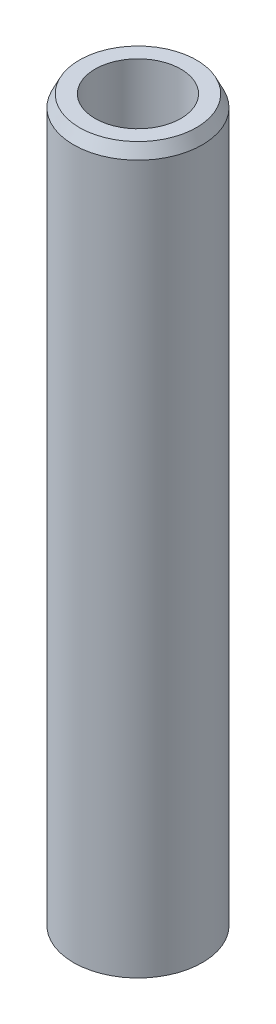
ISO-10303-21;
HEADER;
FILE_DESCRIPTION(('STEP AP214'),'2;1');
FILE_NAME('part.step','',(''),(''),'','','');
FILE_SCHEMA(('AUTOMOTIVE_DESIGN { 1 0 10303 214 1 1 1 1 }'));
ENDSEC;
DATA;
#1=APPLICATION_CONTEXT('core data for automotive mechanical design processes');
#2=APPLICATION_PROTOCOL_DEFINITION('international standard','automotive_design',2000,#1);
#3=PRODUCT_CONTEXT('',#1,'mechanical');
#4=PRODUCT('Part','Part','',(#3));
#5=PRODUCT_RELATED_PRODUCT_CATEGORY('part','',(#4));
#6=PRODUCT_DEFINITION_FORMATION('','',#4);
#7=PRODUCT_DEFINITION_CONTEXT('part definition',#1,'design');
#8=PRODUCT_DEFINITION('design','',#6,#7);
#9=PRODUCT_DEFINITION_SHAPE('','',#8);
#10=(LENGTH_UNIT() NAMED_UNIT(*) SI_UNIT(.MILLI.,.METRE.));
#11=(NAMED_UNIT(*) PLANE_ANGLE_UNIT() SI_UNIT($,.RADIAN.));
#12=(NAMED_UNIT(*) SI_UNIT($,.STERADIAN.) SOLID_ANGLE_UNIT());
#13=UNCERTAINTY_MEASURE_WITH_UNIT(LENGTH_MEASURE(1.E-05),#10,'distance_accuracy_value','');
#14=(GEOMETRIC_REPRESENTATION_CONTEXT(3) GLOBAL_UNCERTAINTY_ASSIGNED_CONTEXT((#13)) GLOBAL_UNIT_ASSIGNED_CONTEXT((#10,
#11,#12)) REPRESENTATION_CONTEXT('',''));
#15=CARTESIAN_POINT('',(0.,0.,0.));
#16=DIRECTION('',(0.,0.,1.));
#17=DIRECTION('',(1.,0.,0.));
#18=AXIS2_PLACEMENT_3D('',#15,#16,#17);
#19=CARTESIAN_POINT('',(0.,310.01596612534,0.));
#20=DIRECTION('',(0.,-1.,0.));
#21=DIRECTION('',(0.,0.,-1.));
#22=AXIS2_PLACEMENT_3D('',#19,#20,#21);
#23=CYLINDRICAL_SURFACE('',#22,27.5);
#24=CARTESIAN_POINT('',(0.,304.893666711075,0.));
#25=DIRECTION('',(0.,1.,0.));
#26=DIRECTION('',(0.,0.,1.));
#27=AXIS2_PLACEMENT_3D('',#24,#25,#26);
#28=CIRCLE('',#27,27.5);
#29=CARTESIAN_POINT('',(0.,304.893666711075,27.5));
#30=VERTEX_POINT('',#29);
#31=EDGE_CURVE('E50',#30,#30,#28,.F.);
#32=ORIENTED_EDGE('',*,*,#31,.T.);
#33=EDGE_LOOP('',(#32));
#34=FACE_BOUND('',#33,.T.);
#35=CARTESIAN_POINT('',(0.,2.50613545823342,0.));
#36=DIRECTION('',(0.,1.,0.));
#37=DIRECTION('',(0.,0.,1.));
#38=AXIS2_PLACEMENT_3D('',#35,#36,#37);
#39=CIRCLE('',#38,27.5);
#40=CARTESIAN_POINT('',(0.,2.50613545823342,27.5));
#41=VERTEX_POINT('',#40);
#42=EDGE_CURVE('E51',#41,#41,#39,.T.);
#43=ORIENTED_EDGE('',*,*,#42,.T.);
#44=EDGE_LOOP('',(#43));
#45=FACE_BOUND('',#44,.T.);
#46=ADVANCED_FACE('F39',(#34,#45),#23,.T.);
#47=CARTESIAN_POINT('',(0.,310.01596612534,0.));
#48=DIRECTION('',(0.,1.,0.));
#49=DIRECTION('',(0.,0.,1.));
#50=AXIS2_PLACEMENT_3D('',#47,#48,#49);
#51=PLANE('',#50);
#52=CARTESIAN_POINT('',(0.,310.01596612534,0.));
#53=DIRECTION('',(0.,1.,0.));
#54=DIRECTION('',(0.,0.,1.));
#55=AXIS2_PLACEMENT_3D('',#52,#53,#54);
#56=CIRCLE('',#55,24.9938645417666);
#57=CARTESIAN_POINT('',(0.,310.01596612534,24.9938645417666));
#58=VERTEX_POINT('',#57);
#59=EDGE_CURVE('E54',#58,#58,#56,.T.);
#60=ORIENTED_EDGE('',*,*,#59,.T.);
#61=EDGE_LOOP('',(#60));
#62=FACE_BOUND('',#61,.T.);
#63=CARTESIAN_POINT('',(0.,310.01596612534,0.));
#64=DIRECTION('',(0.,1.,0.));
#65=DIRECTION('',(0.,0.,1.));
#66=AXIS2_PLACEMENT_3D('',#63,#64,#65);
#67=CIRCLE('',#66,18.3057911645971);
#68=CARTESIAN_POINT('',(0.,310.01596612534,18.3057911645971));
#69=VERTEX_POINT('',#68);
#70=EDGE_CURVE('E58',#69,#69,#67,.T.);
#71=ORIENTED_EDGE('',*,*,#70,.F.);
#72=EDGE_LOOP('',(#71));
#73=FACE_BOUND('',#72,.T.);
#74=ADVANCED_FACE('F69',(#62,#73),#51,.T.);
#75=CARTESIAN_POINT('',(0.,0.,0.));
#76=DIRECTION('',(0.,1.,0.));
#77=DIRECTION('',(0.,0.,1.));
#78=AXIS2_PLACEMENT_3D('',#75,#76,#77);
#79=PLANE('',#78);
#80=CARTESIAN_POINT('',(0.,0.,0.));
#81=DIRECTION('',(0.,1.,0.));
#82=DIRECTION('',(0.,0.,1.));
#83=AXIS2_PLACEMENT_3D('',#80,#81,#82);
#84=CIRCLE('',#83,22.3777005857352);
#85=CARTESIAN_POINT('',(0.,0.,22.3777005857352));
#86=VERTEX_POINT('',#85);
#87=EDGE_CURVE('E10',#86,#86,#84,.F.);
#88=ORIENTED_EDGE('',*,*,#87,.T.);
#89=EDGE_LOOP('',(#88));
#90=FACE_BOUND('',#89,.T.);
#91=CARTESIAN_POINT('',(0.,0.,0.));
#92=DIRECTION('',(0.,1.,0.));
#93=DIRECTION('',(0.,0.,1.));
#94=AXIS2_PLACEMENT_3D('',#91,#92,#93);
#95=CIRCLE('',#94,18.3057911645971);
#96=CARTESIAN_POINT('',(0.,0.,18.3057911645971));
#97=VERTEX_POINT('',#96);
#98=EDGE_CURVE('E63',#97,#97,#95,.T.);
#99=ORIENTED_EDGE('',*,*,#98,.T.);
#100=EDGE_LOOP('',(#99));
#101=FACE_BOUND('',#100,.T.);
#102=ADVANCED_FACE('F75',(#90,#101),#79,.F.);
#103=CARTESIAN_POINT('',(0.,310.01596612534,0.));
#104=DIRECTION('',(0.,-1.,0.));
#105=DIRECTION('',(0.,0.,-1.));
#106=AXIS2_PLACEMENT_3D('',#103,#104,#105);
#107=CYLINDRICAL_SURFACE('',#106,18.3057911645971);
#108=ORIENTED_EDGE('',*,*,#70,.T.);
#109=EDGE_LOOP('',(#108));
#110=FACE_BOUND('',#109,.T.);
#111=ORIENTED_EDGE('',*,*,#98,.F.);
#112=EDGE_LOOP('',(#111));
#113=FACE_BOUND('',#112,.T.);
#114=ADVANCED_FACE('F70',(#110,#113),#107,.F.);
#115=CARTESIAN_POINT('',(0.,310.01596612534,0.));
#116=DIRECTION('',(0.,-1.,0.));
#117=DIRECTION('',(0.,0.,-1.));
#118=AXIS2_PLACEMENT_3D('',#115,#116,#117);
#119=CONICAL_SURFACE('',#118,24.9938645417666,0.455018634038916);
#120=ORIENTED_EDGE('',*,*,#31,.F.);
#121=EDGE_LOOP('',(#120));
#122=FACE_BOUND('',#121,.T.);
#123=ORIENTED_EDGE('',*,*,#59,.F.);
#124=EDGE_LOOP('',(#123));
#125=FACE_BOUND('',#124,.T.);
#126=ADVANCED_FACE('F81',(#122,#125),#119,.T.);
#127=CARTESIAN_POINT('',(0.,2.50613545823342,0.));
#128=DIRECTION('',(0.,1.,0.));
#129=DIRECTION('',(0.,0.,1.));
#130=AXIS2_PLACEMENT_3D('',#127,#128,#129);
#131=CONICAL_SURFACE('',#130,27.5,1.11577769275598);
#132=ORIENTED_EDGE('',*,*,#87,.F.);
#133=EDGE_LOOP('',(#132));
#134=FACE_BOUND('',#133,.T.);
#135=ORIENTED_EDGE('',*,*,#42,.F.);
#136=EDGE_LOOP('',(#135));
#137=FACE_BOUND('',#136,.T.);
#138=ADVANCED_FACE('F45',(#134,#137),#131,.T.);
#139=CLOSED_SHELL('',(#46,#74,#102,#114,#126,#138));
#140=MANIFOLD_SOLID_BREP('B2',#139);
#141=ADVANCED_BREP_SHAPE_REPRESENTATION('',(#18,#140),#14);
#142=SHAPE_DEFINITION_REPRESENTATION(#9,#141);
ENDSEC;
END-ISO-10303-21;
